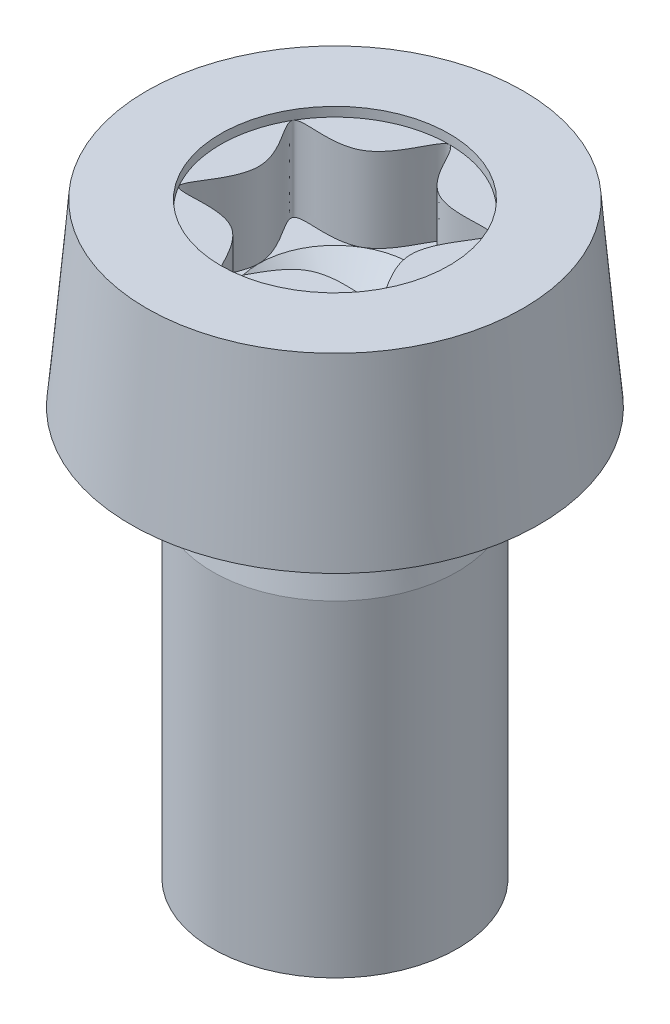
ISO-10303-21;
HEADER;
FILE_DESCRIPTION(('STEP AP214'),'2;1');
FILE_NAME('part.step','',(''),(''),'','','');
FILE_SCHEMA(('AUTOMOTIVE_DESIGN { 1 0 10303 214 1 1 1 1 }'));
ENDSEC;
DATA;
#1=APPLICATION_CONTEXT('core data for automotive mechanical design processes');
#2=APPLICATION_PROTOCOL_DEFINITION('international standard','automotive_design',2000,#1);
#3=PRODUCT_CONTEXT('',#1,'mechanical');
#4=PRODUCT('Part','Part','',(#3));
#5=PRODUCT_RELATED_PRODUCT_CATEGORY('part','',(#4));
#6=PRODUCT_DEFINITION_FORMATION('','',#4);
#7=PRODUCT_DEFINITION_CONTEXT('part definition',#1,'design');
#8=PRODUCT_DEFINITION('design','',#6,#7);
#9=PRODUCT_DEFINITION_SHAPE('','',#8);
#10=(LENGTH_UNIT() NAMED_UNIT(*) SI_UNIT(.MILLI.,.METRE.));
#11=(NAMED_UNIT(*) PLANE_ANGLE_UNIT() SI_UNIT($,.RADIAN.));
#12=(NAMED_UNIT(*) SI_UNIT($,.STERADIAN.) SOLID_ANGLE_UNIT());
#13=UNCERTAINTY_MEASURE_WITH_UNIT(LENGTH_MEASURE(1.E-05),#10,'distance_accuracy_value','');
#14=(GEOMETRIC_REPRESENTATION_CONTEXT(3) GLOBAL_UNCERTAINTY_ASSIGNED_CONTEXT((#13)) GLOBAL_UNIT_ASSIGNED_CONTEXT((#10,
#11,#12)) REPRESENTATION_CONTEXT('',''));
#15=CARTESIAN_POINT('',(0.,0.,0.));
#16=DIRECTION('',(0.,0.,1.));
#17=DIRECTION('',(1.,0.,0.));
#18=AXIS2_PLACEMENT_3D('',#15,#16,#17);
#19=CARTESIAN_POINT('',(0.,12.11,2.8));
#20=DIRECTION('',(0.,1.,0.));
#21=DIRECTION('',(0.,0.,1.));
#22=AXIS2_PLACEMENT_3D('',#19,#20,#21);
#23=PLANE('',#22);
#24=CARTESIAN_POINT('',(0.,12.11,-2.8));
#25=CARTESIAN_POINT('',(0.20130187734414,12.11,-2.79999999999999));
#26=CARTESIAN_POINT('',(0.603905632032412,12.11,-1.04599523765715));
#27=CARTESIAN_POINT('',(3.18437747187033,12.11,-1.83850119058572));
#28=CARTESIAN_POINT('',(1.20781126406484,12.11,0.));
#29=CARTESIAN_POINT('',(3.18437747187033,12.11,1.83850119058571));
#30=CARTESIAN_POINT('',(0.603905632032424,12.11,1.04599523765716));
#31=CARTESIAN_POINT('',(0.,12.11,3.67700238117141));
#32=CARTESIAN_POINT('',(-0.603905632032438,12.11,1.04599523765718));
#33=CARTESIAN_POINT('',(-3.18437747187032,12.11,1.83850119058571));
#34=CARTESIAN_POINT('',(-1.20781126406483,12.11,0.));
#35=CARTESIAN_POINT('',(-3.18437747187032,12.11,-1.83850119058571));
#36=CARTESIAN_POINT('',(-0.603905632032435,12.11,-1.04599523765716));
#37=CARTESIAN_POINT('',(-0.201301877344143,12.11,-2.80000000000001));
#38=CARTESIAN_POINT('',(0.,12.11,-2.8));
#39=B_SPLINE_CURVE_WITH_KNOTS('',3,(#24,#25,#26,#27,#28,#29,#30,#31,#32,#33,#34,#35,#36,#37,
#38),.UNSPECIFIED.,.T.,.F.,(4,1,1,1,1,1,1,1,1,1,1,1,4),(0.,0.0833333333333329,0.166666666666667,
0.25,0.333333333333334,0.416666666666668,0.5,0.583333333333333,0.666666666666667,0.75,
0.833333333333334,0.916666666666666,1.),.UNSPECIFIED.);
#40=CARTESIAN_POINT('',(0.933333333333328,12.11,-1.61658075373095));
#41=VERTEX_POINT('',#40);
#42=CARTESIAN_POINT('',(1.8666666666665,12.11,0.));
#43=VERTEX_POINT('',#42);
#44=EDGE_CURVE('E144',#41,#43,#39,.T.);
#45=ORIENTED_EDGE('',*,*,#44,.F.);
#46=CARTESIAN_POINT('',(0.,12.11,0.));
#47=DIRECTION('',(0.,-1.,0.));
#48=DIRECTION('',(0.,0.,-1.));
#49=AXIS2_PLACEMENT_3D('',#46,#47,#48);
#50=CIRCLE('',#49,1.8666666666665);
#51=EDGE_CURVE('E55',#41,#43,#50,.T.);
#52=ORIENTED_EDGE('',*,*,#51,.T.);
#53=EDGE_LOOP('',(#45,#52));
#54=FACE_BOUND('',#53,.T.);
#55=ADVANCED_FACE('F42',(#54),#23,.T.);
#56=CARTESIAN_POINT('',(0.933333333333247,12.11,1.61658075373081));
#57=VERTEX_POINT('',#56);
#58=EDGE_CURVE('E159',#43,#57,#39,.T.);
#59=ORIENTED_EDGE('',*,*,#58,.F.);
#60=EDGE_CURVE('E11',#43,#57,#50,.T.);
#61=ORIENTED_EDGE('',*,*,#60,.T.);
#62=EDGE_LOOP('',(#59,#61));
#63=FACE_BOUND('',#62,.T.);
#64=ADVANCED_FACE('F112',(#63),#23,.T.);
#65=CARTESIAN_POINT('',(-0.93333333333325,12.11,1.61658075373081));
#66=VERTEX_POINT('',#65);
#67=EDGE_CURVE('E152',#57,#66,#39,.T.);
#68=ORIENTED_EDGE('',*,*,#67,.F.);
#69=EDGE_CURVE('E53',#57,#66,#50,.T.);
#70=ORIENTED_EDGE('',*,*,#69,.T.);
#71=EDGE_LOOP('',(#68,#70));
#72=FACE_BOUND('',#71,.T.);
#73=ADVANCED_FACE('F119',(#72),#23,.T.);
#74=CARTESIAN_POINT('',(-1.8666666666665,12.11,0.));
#75=VERTEX_POINT('',#74);
#76=EDGE_CURVE('E150',#66,#75,#39,.T.);
#77=ORIENTED_EDGE('',*,*,#76,.F.);
#78=EDGE_CURVE('E437',#66,#75,#50,.T.);
#79=ORIENTED_EDGE('',*,*,#78,.T.);
#80=EDGE_LOOP('',(#77,#79));
#81=FACE_BOUND('',#80,.T.);
#82=ADVANCED_FACE('F133',(#81),#23,.T.);
#83=CARTESIAN_POINT('',(-0.933333333333257,12.11,-1.6165807537308));
#84=VERTEX_POINT('',#83);
#85=EDGE_CURVE('E141',#75,#84,#39,.T.);
#86=ORIENTED_EDGE('',*,*,#85,.F.);
#87=EDGE_CURVE('E214',#75,#84,#50,.T.);
#88=ORIENTED_EDGE('',*,*,#87,.T.);
#89=EDGE_LOOP('',(#86,#88));
#90=FACE_BOUND('',#89,.T.);
#91=ADVANCED_FACE('F125',(#90),#23,.T.);
#92=EDGE_CURVE('E137',#84,#41,#39,.T.);
#93=ORIENTED_EDGE('',*,*,#92,.F.);
#94=EDGE_CURVE('E139',#84,#41,#50,.T.);
#95=ORIENTED_EDGE('',*,*,#94,.T.);
#96=EDGE_LOOP('',(#93,#95));
#97=FACE_BOUND('',#96,.T.);
#98=ADVANCED_FACE('F115',(#97),#23,.T.);
#99=CARTESIAN_POINT('',(0.,14.4,0.));
#100=DIRECTION('',(0.,1.,0.));
#101=DIRECTION('',(0.,0.,1.));
#102=AXIS2_PLACEMENT_3D('',#99,#100,#101);
#103=PLANE('',#102);
#104=CARTESIAN_POINT('',(0.,14.4,0.));
#105=DIRECTION('',(0.,1.,0.));
#106=DIRECTION('',(0.,0.,1.));
#107=AXIS2_PLACEMENT_3D('',#104,#105,#106);
#108=CIRCLE('',#107,2.8);
#109=CARTESIAN_POINT('',(0.,14.4,2.8));
#110=VERTEX_POINT('',#109);
#111=EDGE_CURVE('E160',#110,#110,#108,.T.);
#112=ORIENTED_EDGE('',*,*,#111,.F.);
#113=EDGE_LOOP('',(#112));
#114=FACE_BOUND('',#113,.T.);
#115=CARTESIAN_POINT('',(0.,14.4,0.));
#116=DIRECTION('',(0.,-1.,0.));
#117=DIRECTION('',(0.,0.,-1.));
#118=AXIS2_PLACEMENT_3D('',#115,#116,#117);
#119=CIRCLE('',#118,4.61504988048596);
#120=CARTESIAN_POINT('',(0.,14.4,-4.61504988048596));
#121=VERTEX_POINT('',#120);
#122=EDGE_CURVE('E190',#121,#121,#119,.T.);
#123=ORIENTED_EDGE('',*,*,#122,.F.);
#124=EDGE_LOOP('',(#123));
#125=FACE_BOUND('',#124,.T.);
#126=ADVANCED_FACE('F124',(#114,#125),#103,.T.);
#127=CARTESIAN_POINT('',(0.,10.,0.));
#128=DIRECTION('',(0.,-1.,0.));
#129=DIRECTION('',(0.,0.,-1.));
#130=AXIS2_PLACEMENT_3D('',#127,#128,#129);
#131=CONICAL_SURFACE('',#130,5.,0.0872664625997098);
#132=ORIENTED_EDGE('',*,*,#122,.T.);
#133=EDGE_LOOP('',(#132));
#134=FACE_BOUND('',#133,.T.);
#135=CARTESIAN_POINT('',(0.,10.,0.));
#136=DIRECTION('',(0.,-1.,0.));
#137=DIRECTION('',(0.,0.,-1.));
#138=AXIS2_PLACEMENT_3D('',#135,#136,#137);
#139=CIRCLE('',#138,5.);
#140=CARTESIAN_POINT('',(0.,10.,-5.));
#141=VERTEX_POINT('',#140);
#142=EDGE_CURVE('E193',#141,#141,#139,.T.);
#143=ORIENTED_EDGE('',*,*,#142,.F.);
#144=EDGE_LOOP('',(#143));
#145=FACE_BOUND('',#144,.T.);
#146=ADVANCED_FACE('F131',(#134,#145),#131,.T.);
#147=CARTESIAN_POINT('',(2.6,10.,0.));
#148=DIRECTION('',(0.,-1.,0.));
#149=DIRECTION('',(0.,0.,-1.));
#150=AXIS2_PLACEMENT_3D('',#147,#148,#149);
#151=PLANE('',#150);
#152=CARTESIAN_POINT('',(0.,10.,0.));
#153=DIRECTION('',(0.,-1.,0.));
#154=DIRECTION('',(0.,0.,-1.));
#155=AXIS2_PLACEMENT_3D('',#152,#153,#154);
#156=CIRCLE('',#155,2.90495097567964);
#157=CARTESIAN_POINT('',(0.,10.,-2.90495097567964));
#158=VERTEX_POINT('',#157);
#159=EDGE_CURVE('E202',#158,#158,#156,.F.);
#160=ORIENTED_EDGE('',*,*,#159,.T.);
#161=EDGE_LOOP('',(#160));
#162=FACE_BOUND('',#161,.T.);
#163=ORIENTED_EDGE('',*,*,#142,.T.);
#164=EDGE_LOOP('',(#163));
#165=FACE_BOUND('',#164,.T.);
#166=ADVANCED_FACE('F178',(#162,#165),#151,.T.);
#167=CARTESIAN_POINT('',(0.,8.,0.));
#168=DIRECTION('',(0.,-1.,0.));
#169=DIRECTION('',(0.,0.,-1.));
#170=AXIS2_PLACEMENT_3D('',#167,#168,#169);
#171=CONICAL_SURFACE('',#170,3.,0.197395559849881);
#172=CARTESIAN_POINT('',(0.,9.70097096621545,0.));
#173=DIRECTION('',(0.,-1.,0.));
#174=DIRECTION('',(0.,0.,-1.));
#175=AXIS2_PLACEMENT_3D('',#172,#173,#174);
#176=CIRCLE('',#175,2.65980580675691);
#177=CARTESIAN_POINT('',(0.,9.70097096621545,-2.65980580675691));
#178=VERTEX_POINT('',#177);
#179=EDGE_CURVE('E197',#178,#178,#176,.T.);
#180=ORIENTED_EDGE('',*,*,#179,.T.);
#181=EDGE_LOOP('',(#180));
#182=FACE_BOUND('',#181,.T.);
#183=CARTESIAN_POINT('',(0.,8.,0.));
#184=DIRECTION('',(0.,-1.,0.));
#185=DIRECTION('',(0.,0.,-1.));
#186=AXIS2_PLACEMENT_3D('',#183,#184,#185);
#187=CIRCLE('',#186,3.);
#188=CARTESIAN_POINT('',(0.,8.,-3.));
#189=VERTEX_POINT('',#188);
#190=EDGE_CURVE('E195',#189,#189,#187,.T.);
#191=ORIENTED_EDGE('',*,*,#190,.F.);
#192=EDGE_LOOP('',(#191));
#193=FACE_BOUND('',#192,.T.);
#194=ADVANCED_FACE('F174',(#182,#193),#171,.T.);
#195=CARTESIAN_POINT('',(0.,0.,0.));
#196=DIRECTION('',(0.,-1.,0.));
#197=DIRECTION('',(0.,0.,-1.));
#198=AXIS2_PLACEMENT_3D('',#195,#196,#197);
#199=CYLINDRICAL_SURFACE('',#198,3.);
#200=ORIENTED_EDGE('',*,*,#190,.T.);
#201=EDGE_LOOP('',(#200));
#202=FACE_BOUND('',#201,.T.);
#203=CARTESIAN_POINT('',(0.,0.,0.));
#204=DIRECTION('',(0.,-1.,0.));
#205=DIRECTION('',(0.,0.,-1.));
#206=AXIS2_PLACEMENT_3D('',#203,#204,#205);
#207=CIRCLE('',#206,3.);
#208=CARTESIAN_POINT('',(0.,0.,-3.));
#209=VERTEX_POINT('',#208);
#210=EDGE_CURVE('E158',#209,#209,#207,.T.);
#211=ORIENTED_EDGE('',*,*,#210,.F.);
#212=EDGE_LOOP('',(#211));
#213=FACE_BOUND('',#212,.T.);
#214=ADVANCED_FACE('F170',(#202,#213),#199,.T.);
#215=CARTESIAN_POINT('',(3.,0.,0.));
#216=DIRECTION('',(0.,-1.,0.));
#217=DIRECTION('',(0.,0.,-1.));
#218=AXIS2_PLACEMENT_3D('',#215,#216,#217);
#219=PLANE('',#218);
#220=ORIENTED_EDGE('',*,*,#210,.T.);
#221=EDGE_LOOP('',(#220));
#222=FACE_BOUND('',#221,.T.);
#223=ADVANCED_FACE('F167',(#222),#219,.T.);
#224=CARTESIAN_POINT('',(0.,9.75,0.));
#225=DIRECTION('',(0.,-1.,0.));
#226=DIRECTION('',(0.,0.,-1.));
#227=AXIS2_PLACEMENT_3D('',#224,#225,#226);
#228=TOROIDAL_SURFACE('',#227,2.90495097567964,0.25);
#229=ORIENTED_EDGE('',*,*,#159,.F.);
#230=EDGE_LOOP('',(#229));
#231=FACE_BOUND('',#230,.T.);
#232=ORIENTED_EDGE('',*,*,#179,.F.);
#233=EDGE_LOOP('',(#232));
#234=FACE_BOUND('',#233,.T.);
#235=ADVANCED_FACE('F44',(#231,#234),#228,.F.);
#236=CARTESIAN_POINT('',(0.,14.171,0.));
#237=DIRECTION('',(0.,1.,0.));
#238=DIRECTION('',(0.,0.,1.));
#239=AXIS2_PLACEMENT_3D('',#236,#237,#238);
#240=CYLINDRICAL_SURFACE('',#239,2.8);
#241=ORIENTED_EDGE('',*,*,#111,.T.);
#242=EDGE_LOOP('',(#241));
#243=FACE_BOUND('',#242,.T.);
#244=CARTESIAN_POINT('',(0.,14.171,0.));
#245=DIRECTION('',(0.,1.,0.));
#246=DIRECTION('',(0.,0.,1.));
#247=AXIS2_PLACEMENT_3D('',#244,#245,#246);
#248=CIRCLE('',#247,2.8);
#249=CARTESIAN_POINT('',(2.42487113059643,14.171,1.4));
#250=VERTEX_POINT('',#249);
#251=CARTESIAN_POINT('',(2.42487113059643,14.171,-1.4));
#252=VERTEX_POINT('',#251);
#253=EDGE_CURVE('E234',#250,#252,#248,.T.);
#254=ORIENTED_EDGE('',*,*,#253,.F.);
#255=CARTESIAN_POINT('',(0.,14.171,2.8));
#256=VERTEX_POINT('',#255);
#257=EDGE_CURVE('E142',#256,#250,#248,.T.);
#258=ORIENTED_EDGE('',*,*,#257,.F.);
#259=CARTESIAN_POINT('',(-2.42487113059643,14.171,1.4));
#260=VERTEX_POINT('',#259);
#261=EDGE_CURVE('E225',#260,#256,#248,.T.);
#262=ORIENTED_EDGE('',*,*,#261,.F.);
#263=CARTESIAN_POINT('',(-2.42487113059643,14.171,-1.4));
#264=VERTEX_POINT('',#263);
#265=EDGE_CURVE('E230',#264,#260,#248,.T.);
#266=ORIENTED_EDGE('',*,*,#265,.F.);
#267=CARTESIAN_POINT('',(0.,14.171,-2.8));
#268=VERTEX_POINT('',#267);
#269=EDGE_CURVE('E268',#268,#264,#248,.T.);
#270=ORIENTED_EDGE('',*,*,#269,.F.);
#271=EDGE_CURVE('E68',#252,#268,#248,.T.);
#272=ORIENTED_EDGE('',*,*,#271,.F.);
#273=EDGE_LOOP('',(#254,#258,#262,#266,#270,#272));
#274=FACE_BOUND('',#273,.T.);
#275=ADVANCED_FACE('F232',(#243,#274),#240,.F.);
#276=CARTESIAN_POINT('',(0.,14.171,0.));
#277=DIRECTION('',(0.,1.,0.));
#278=DIRECTION('',(0.,0.,1.));
#279=AXIS2_PLACEMENT_3D('',#276,#277,#278);
#280=PLANE('',#279);
#281=ORIENTED_EDGE('',*,*,#269,.T.);
#282=CARTESIAN_POINT('',(0.,14.171,-2.8));
#283=CARTESIAN_POINT('',(0.20130187734414,14.171,-2.79999999999999));
#284=CARTESIAN_POINT('',(0.603905632032412,14.171,-1.04599523765715));
#285=CARTESIAN_POINT('',(3.18437747187033,14.171,-1.83850119058572));
#286=CARTESIAN_POINT('',(1.20781126406484,14.171,0.));
#287=CARTESIAN_POINT('',(3.18437747187033,14.171,1.83850119058571));
#288=CARTESIAN_POINT('',(0.603905632032424,14.171,1.04599523765716));
#289=CARTESIAN_POINT('',(0.,14.171,3.67700238117141));
#290=CARTESIAN_POINT('',(-0.603905632032438,14.171,1.04599523765718));
#291=CARTESIAN_POINT('',(-3.18437747187032,14.171,1.83850119058571));
#292=CARTESIAN_POINT('',(-1.20781126406483,14.171,0.));
#293=CARTESIAN_POINT('',(-3.18437747187032,14.171,-1.83850119058571));
#294=CARTESIAN_POINT('',(-0.603905632032435,14.171,-1.04599523765716));
#295=CARTESIAN_POINT('',(-0.201301877344143,14.171,-2.80000000000001));
#296=CARTESIAN_POINT('',(0.,14.171,-2.8));
#297=B_SPLINE_CURVE_WITH_KNOTS('',3,(#282,#283,#284,#285,#286,#287,#288,#289,#290,#291,#292,
#293,#294,#295,#296),.UNSPECIFIED.,.T.,.F.,(4,1,1,1,1,1,1,1,1,1,1,1,4),(0.,0.0833333333333329,
0.166666666666667,0.25,0.333333333333334,0.416666666666668,0.5,0.583333333333333,
0.666666666666667,0.75,0.833333333333334,0.916666666666666,1.),.UNSPECIFIED.);
#298=EDGE_CURVE('E207',#268,#264,#297,.F.);
#299=ORIENTED_EDGE('',*,*,#298,.F.);
#300=EDGE_LOOP('',(#281,#299));
#301=FACE_BOUND('',#300,.T.);
#302=ADVANCED_FACE('F241',(#301),#280,.T.);
#303=ORIENTED_EDGE('',*,*,#265,.T.);
#304=EDGE_CURVE('E211',#264,#260,#297,.F.);
#305=ORIENTED_EDGE('',*,*,#304,.F.);
#306=EDGE_LOOP('',(#303,#305));
#307=FACE_BOUND('',#306,.T.);
#308=ADVANCED_FACE('F246',(#307),#280,.T.);
#309=ORIENTED_EDGE('',*,*,#261,.T.);
#310=EDGE_CURVE('E215',#260,#256,#297,.F.);
#311=ORIENTED_EDGE('',*,*,#310,.F.);
#312=EDGE_LOOP('',(#309,#311));
#313=FACE_BOUND('',#312,.T.);
#314=ADVANCED_FACE('F226',(#313),#280,.T.);
#315=ORIENTED_EDGE('',*,*,#257,.T.);
#316=EDGE_CURVE('E210',#256,#250,#297,.F.);
#317=ORIENTED_EDGE('',*,*,#316,.F.);
#318=EDGE_LOOP('',(#315,#317));
#319=FACE_BOUND('',#318,.T.);
#320=ADVANCED_FACE('F221',(#319),#280,.T.);
#321=ORIENTED_EDGE('',*,*,#253,.T.);
#322=EDGE_CURVE('E206',#250,#252,#297,.F.);
#323=ORIENTED_EDGE('',*,*,#322,.F.);
#324=EDGE_LOOP('',(#321,#323));
#325=FACE_BOUND('',#324,.T.);
#326=ADVANCED_FACE('F250',(#325),#280,.T.);
#327=ORIENTED_EDGE('',*,*,#271,.T.);
#328=EDGE_CURVE('E46',#252,#268,#297,.F.);
#329=ORIENTED_EDGE('',*,*,#328,.F.);
#330=EDGE_LOOP('',(#327,#329));
#331=FACE_BOUND('',#330,.T.);
#332=ADVANCED_FACE('F107',(#331),#280,.T.);
#333=DIRECTION('',(0.,1.,0.));
#334=VECTOR('',#333,1.);
#335=SURFACE_OF_LINEAR_EXTRUSION('',#39,#334);
#336=ORIENTED_EDGE('',*,*,#44,.T.);
#337=ORIENTED_EDGE('',*,*,#58,.T.);
#338=ORIENTED_EDGE('',*,*,#67,.T.);
#339=ORIENTED_EDGE('',*,*,#76,.T.);
#340=ORIENTED_EDGE('',*,*,#85,.T.);
#341=ORIENTED_EDGE('',*,*,#92,.T.);
#342=EDGE_LOOP('',(#336,#337,#338,#339,#340,#341));
#343=FACE_BOUND('',#342,.T.);
#344=ORIENTED_EDGE('',*,*,#328,.T.);
#345=ORIENTED_EDGE('',*,*,#298,.T.);
#346=ORIENTED_EDGE('',*,*,#304,.T.);
#347=ORIENTED_EDGE('',*,*,#310,.T.);
#348=ORIENTED_EDGE('',*,*,#316,.T.);
#349=ORIENTED_EDGE('',*,*,#322,.T.);
#350=EDGE_LOOP('',(#344,#345,#346,#347,#348,#349));
#351=FACE_BOUND('',#350,.T.);
#352=ADVANCED_FACE('F102',(#343,#351),#335,.T.);
#353=CARTESIAN_POINT('',(0.,10.44,0.));
#354=DIRECTION('',(0.,1.,0.));
#355=DIRECTION('',(0.,0.,1.));
#356=AXIS2_PLACEMENT_3D('',#353,#354,#355);
#357=CONICAL_SURFACE('',#356,0.,0.840948868883195);
#358=ORIENTED_EDGE('',*,*,#51,.F.);
#359=ORIENTED_EDGE('',*,*,#94,.F.);
#360=ORIENTED_EDGE('',*,*,#87,.F.);
#361=ORIENTED_EDGE('',*,*,#78,.F.);
#362=ORIENTED_EDGE('',*,*,#69,.F.);
#363=ORIENTED_EDGE('',*,*,#60,.F.);
#364=EDGE_LOOP('',(#358,#359,#360,#361,#362,#363));
#365=FACE_BOUND('',#364,.T.);
#366=CARTESIAN_POINT('',(0.,10.44,0.));
#367=VERTEX_POINT('',#366);
#368=VERTEX_LOOP('',#367);
#369=FACE_BOUND('',#368,.T.);
#370=ADVANCED_FACE('F100',(#365,#369),#357,.F.);
#371=CLOSED_SHELL('',(#55,#64,#73,#82,#91,#98,#126,#146,#166,#194,#214,#223,#235,#275,#302,#308,
#314,#320,#326,#332,#352,#370));
#372=MANIFOLD_SOLID_BREP('B2',#371);
#373=ADVANCED_BREP_SHAPE_REPRESENTATION('',(#18,#372),#14);
#374=SHAPE_DEFINITION_REPRESENTATION(#9,#373);
ENDSEC;
END-ISO-10303-21;
